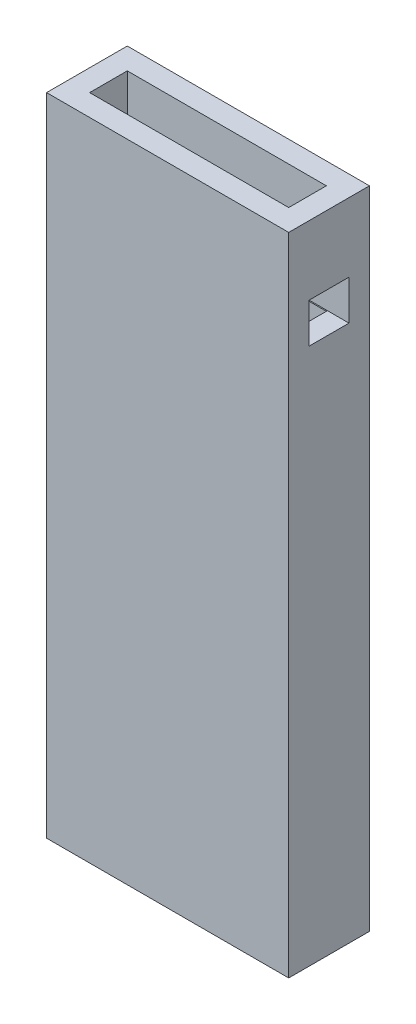
ISO-10303-21;
HEADER;
FILE_DESCRIPTION(('STEP AP214'),'2;1');
FILE_NAME('part.step','',(''),(''),'','','');
FILE_SCHEMA(('AUTOMOTIVE_DESIGN { 1 0 10303 214 1 1 1 1 }'));
ENDSEC;
DATA;
#1=APPLICATION_CONTEXT('core data for automotive mechanical design processes');
#2=APPLICATION_PROTOCOL_DEFINITION('international standard','automotive_design',2000,#1);
#3=PRODUCT_CONTEXT('',#1,'mechanical');
#4=PRODUCT('Part','Part','',(#3));
#5=PRODUCT_RELATED_PRODUCT_CATEGORY('part','',(#4));
#6=PRODUCT_DEFINITION_FORMATION('','',#4);
#7=PRODUCT_DEFINITION_CONTEXT('part definition',#1,'design');
#8=PRODUCT_DEFINITION('design','',#6,#7);
#9=PRODUCT_DEFINITION_SHAPE('','',#8);
#10=(LENGTH_UNIT() NAMED_UNIT(*) SI_UNIT(.MILLI.,.METRE.));
#11=(NAMED_UNIT(*) PLANE_ANGLE_UNIT() SI_UNIT($,.RADIAN.));
#12=(NAMED_UNIT(*) SI_UNIT($,.STERADIAN.) SOLID_ANGLE_UNIT());
#13=UNCERTAINTY_MEASURE_WITH_UNIT(LENGTH_MEASURE(1.E-05),#10,'distance_accuracy_value','');
#14=(GEOMETRIC_REPRESENTATION_CONTEXT(3) GLOBAL_UNCERTAINTY_ASSIGNED_CONTEXT((#13)) GLOBAL_UNIT_ASSIGNED_CONTEXT((#10,
#11,#12)) REPRESENTATION_CONTEXT('',''));
#15=CARTESIAN_POINT('',(0.,0.,0.));
#16=DIRECTION('',(0.,0.,1.));
#17=DIRECTION('',(1.,0.,0.));
#18=AXIS2_PLACEMENT_3D('',#15,#16,#17);
#19=CARTESIAN_POINT('',(11.3,-55.2,2.13619599600161));
#20=DIRECTION('',(-1.,0.,0.));
#21=DIRECTION('',(0.,0.,-1.));
#22=AXIS2_PLACEMENT_3D('',#19,#20,#21);
#23=PLANE('',#22);
#24=DIRECTION('',(0.,0.,1.));
#25=VECTOR('',#24,1.);
#26=CARTESIAN_POINT('',(11.3,-58.8,2.13619599600161));
#27=LINE('',#26,#25);
#28=CARTESIAN_POINT('',(11.3,-58.8,-2.13619599600162));
#29=VERTEX_POINT('',#28);
#30=CARTESIAN_POINT('',(11.3,-58.8,2.13619599600161));
#31=VERTEX_POINT('',#30);
#32=EDGE_CURVE('E301',#29,#31,#27,.T.);
#33=ORIENTED_EDGE('',*,*,#32,.F.);
#34=DIRECTION('',(0.,-1.,0.));
#35=VECTOR('',#34,1.);
#36=CARTESIAN_POINT('',(11.3,-55.2,-2.13619599600162));
#37=LINE('',#36,#35);
#38=CARTESIAN_POINT('',(11.3,-55.2,-2.13619599600162));
#39=VERTEX_POINT('',#38);
#40=EDGE_CURVE('E336',#39,#29,#37,.T.);
#41=ORIENTED_EDGE('',*,*,#40,.F.);
#42=DIRECTION('',(0.,0.,1.));
#43=VECTOR('',#42,1.);
#44=CARTESIAN_POINT('',(11.3,-55.2,2.13619599600161));
#45=LINE('',#44,#43);
#46=CARTESIAN_POINT('',(11.3,-55.2,2.13619599600161));
#47=VERTEX_POINT('',#46);
#48=EDGE_CURVE('E343',#39,#47,#45,.T.);
#49=ORIENTED_EDGE('',*,*,#48,.T.);
#50=DIRECTION('',(0.,-1.,0.));
#51=VECTOR('',#50,1.);
#52=CARTESIAN_POINT('',(11.3,-55.2,2.13619599600161));
#53=LINE('',#52,#51);
#54=EDGE_CURVE('E320',#47,#31,#53,.T.);
#55=ORIENTED_EDGE('',*,*,#54,.T.);
#56=EDGE_LOOP('',(#33,#41,#49,#55));
#57=FACE_BOUND('',#56,.T.);
#58=ADVANCED_FACE('F36',(#57),#23,.F.);
#59=CARTESIAN_POINT('',(11.3,-55.2,-2.13619599600162));
#60=DIRECTION('',(-0.5,0.,-0.866025403784438));
#61=DIRECTION('',(0.866025403784439,0.,-0.5));
#62=AXIS2_PLACEMENT_3D('',#59,#60,#61);
#63=PLANE('',#62);
#64=DIRECTION('',(-0.866025403784439,0.,0.5));
#65=VECTOR('',#64,1.);
#66=CARTESIAN_POINT('',(11.3,-58.8,-2.13619599600162));
#67=LINE('',#66,#65);
#68=CARTESIAN_POINT('',(15.,-58.8,-4.27239199200324));
#69=VERTEX_POINT('',#68);
#70=EDGE_CURVE('E340',#69,#29,#67,.T.);
#71=ORIENTED_EDGE('',*,*,#70,.F.);
#72=DIRECTION('',(0.,-1.,0.));
#73=VECTOR('',#72,1.);
#74=CARTESIAN_POINT('',(15.,-55.2,-4.27239199200324));
#75=LINE('',#74,#73);
#76=CARTESIAN_POINT('',(15.,-55.2,-4.27239199200324));
#77=VERTEX_POINT('',#76);
#78=EDGE_CURVE('E333',#77,#69,#75,.T.);
#79=ORIENTED_EDGE('',*,*,#78,.F.);
#80=DIRECTION('',(-0.866025403784439,0.,0.5));
#81=VECTOR('',#80,1.);
#82=CARTESIAN_POINT('',(11.3,-55.2,-2.13619599600162));
#83=LINE('',#82,#81);
#84=EDGE_CURVE('E323',#77,#39,#83,.T.);
#85=ORIENTED_EDGE('',*,*,#84,.T.);
#86=ORIENTED_EDGE('',*,*,#40,.T.);
#87=EDGE_LOOP('',(#71,#79,#85,#86));
#88=FACE_BOUND('',#87,.T.);
#89=ADVANCED_FACE('F587',(#88),#63,.F.);
#90=CARTESIAN_POINT('',(15.,-55.2,-4.27239199200324));
#91=DIRECTION('',(0.5,0.,-0.866025403784439));
#92=DIRECTION('',(0.866025403784439,0.,0.5));
#93=AXIS2_PLACEMENT_3D('',#90,#91,#92);
#94=PLANE('',#93);
#95=DIRECTION('',(-0.866025403784439,0.,-0.5));
#96=VECTOR('',#95,1.);
#97=CARTESIAN_POINT('',(15.,-58.8,-4.27239199200324));
#98=LINE('',#97,#96);
#99=CARTESIAN_POINT('',(18.7,-58.8,-2.13619599600163));
#100=VERTEX_POINT('',#99);
#101=EDGE_CURVE('E342',#100,#69,#98,.T.);
#102=ORIENTED_EDGE('',*,*,#101,.F.);
#103=DIRECTION('',(0.,-1.,0.));
#104=VECTOR('',#103,1.);
#105=CARTESIAN_POINT('',(18.7,-55.2,-2.13619599600163));
#106=LINE('',#105,#104);
#107=CARTESIAN_POINT('',(18.7,-55.2,-2.13619599600163));
#108=VERTEX_POINT('',#107);
#109=EDGE_CURVE('E330',#108,#100,#106,.T.);
#110=ORIENTED_EDGE('',*,*,#109,.F.);
#111=DIRECTION('',(-0.866025403784439,0.,-0.5));
#112=VECTOR('',#111,1.);
#113=CARTESIAN_POINT('',(15.,-55.2,-4.27239199200324));
#114=LINE('',#113,#112);
#115=EDGE_CURVE('E354',#108,#77,#114,.T.);
#116=ORIENTED_EDGE('',*,*,#115,.T.);
#117=ORIENTED_EDGE('',*,*,#78,.T.);
#118=EDGE_LOOP('',(#102,#110,#116,#117));
#119=FACE_BOUND('',#118,.T.);
#120=ADVANCED_FACE('F593',(#119),#94,.F.);
#121=CARTESIAN_POINT('',(18.7,-55.2,-2.13619599600163));
#122=DIRECTION('',(1.,0.,0.));
#123=DIRECTION('',(0.,0.,1.));
#124=AXIS2_PLACEMENT_3D('',#121,#122,#123);
#125=PLANE('',#124);
#126=DIRECTION('',(0.,0.,-1.));
#127=VECTOR('',#126,1.);
#128=CARTESIAN_POINT('',(18.7,-58.8,-2.13619599600163));
#129=LINE('',#128,#127);
#130=CARTESIAN_POINT('',(18.7,-58.8,2.13619599600161));
#131=VERTEX_POINT('',#130);
#132=EDGE_CURVE('E345',#131,#100,#129,.T.);
#133=ORIENTED_EDGE('',*,*,#132,.F.);
#134=DIRECTION('',(0.,-1.,0.));
#135=VECTOR('',#134,1.);
#136=CARTESIAN_POINT('',(18.7,-55.2,2.13619599600161));
#137=LINE('',#136,#135);
#138=CARTESIAN_POINT('',(18.7,-55.2,2.13619599600161));
#139=VERTEX_POINT('',#138);
#140=EDGE_CURVE('E327',#139,#131,#137,.T.);
#141=ORIENTED_EDGE('',*,*,#140,.F.);
#142=DIRECTION('',(0.,0.,-1.));
#143=VECTOR('',#142,1.);
#144=CARTESIAN_POINT('',(18.7,-55.2,-2.13619599600163));
#145=LINE('',#144,#143);
#146=EDGE_CURVE('E356',#139,#108,#145,.T.);
#147=ORIENTED_EDGE('',*,*,#146,.T.);
#148=ORIENTED_EDGE('',*,*,#109,.T.);
#149=EDGE_LOOP('',(#133,#141,#147,#148));
#150=FACE_BOUND('',#149,.T.);
#151=ADVANCED_FACE('F608',(#150),#125,.F.);
#152=CARTESIAN_POINT('',(18.7,-55.2,2.13619599600161));
#153=DIRECTION('',(0.5,0.,0.866025403784438));
#154=DIRECTION('',(-0.866025403784439,0.,0.5));
#155=AXIS2_PLACEMENT_3D('',#152,#153,#154);
#156=PLANE('',#155);
#157=DIRECTION('',(0.866025403784439,0.,-0.5));
#158=VECTOR('',#157,1.);
#159=CARTESIAN_POINT('',(18.7,-58.8,2.13619599600161));
#160=LINE('',#159,#158);
#161=CARTESIAN_POINT('',(15.,-58.8,4.27239199200323));
#162=VERTEX_POINT('',#161);
#163=EDGE_CURVE('E347',#162,#131,#160,.T.);
#164=ORIENTED_EDGE('',*,*,#163,.F.);
#165=DIRECTION('',(0.,-1.,0.));
#166=VECTOR('',#165,1.);
#167=CARTESIAN_POINT('',(15.,-55.2,4.27239199200323));
#168=LINE('',#167,#166);
#169=CARTESIAN_POINT('',(15.,-55.2,4.27239199200323));
#170=VERTEX_POINT('',#169);
#171=EDGE_CURVE('E324',#170,#162,#168,.T.);
#172=ORIENTED_EDGE('',*,*,#171,.F.);
#173=DIRECTION('',(0.866025403784439,0.,-0.5));
#174=VECTOR('',#173,1.);
#175=CARTESIAN_POINT('',(18.7,-55.2,2.13619599600161));
#176=LINE('',#175,#174);
#177=EDGE_CURVE('E358',#170,#139,#176,.T.);
#178=ORIENTED_EDGE('',*,*,#177,.T.);
#179=ORIENTED_EDGE('',*,*,#140,.T.);
#180=EDGE_LOOP('',(#164,#172,#178,#179));
#181=FACE_BOUND('',#180,.T.);
#182=ADVANCED_FACE('F604',(#181),#156,.F.);
#183=CARTESIAN_POINT('',(15.,-55.2,4.27239199200323));
#184=DIRECTION('',(-0.5,0.,0.866025403784439));
#185=DIRECTION('',(-0.866025403784439,0.,-0.5));
#186=AXIS2_PLACEMENT_3D('',#183,#184,#185);
#187=PLANE('',#186);
#188=DIRECTION('',(0.866025403784439,0.,0.5));
#189=VECTOR('',#188,1.);
#190=CARTESIAN_POINT('',(15.,-58.8,4.27239199200323));
#191=LINE('',#190,#189);
#192=EDGE_CURVE('E349',#31,#162,#191,.T.);
#193=ORIENTED_EDGE('',*,*,#192,.F.);
#194=ORIENTED_EDGE('',*,*,#54,.F.);
#195=DIRECTION('',(0.866025403784439,0.,0.5));
#196=VECTOR('',#195,1.);
#197=CARTESIAN_POINT('',(15.,-55.2,4.27239199200323));
#198=LINE('',#197,#196);
#199=EDGE_CURVE('E360',#47,#170,#198,.T.);
#200=ORIENTED_EDGE('',*,*,#199,.T.);
#201=ORIENTED_EDGE('',*,*,#171,.T.);
#202=EDGE_LOOP('',(#193,#194,#200,#201));
#203=FACE_BOUND('',#202,.T.);
#204=ADVANCED_FACE('F600',(#203),#187,.F.);
#205=CARTESIAN_POINT('',(0.,-55.2,0.));
#206=DIRECTION('',(0.,1.,0.));
#207=DIRECTION('',(0.,0.,-1.));
#208=AXIS2_PLACEMENT_3D('',#205,#206,#207);
#209=PLANE('',#208);
#210=ORIENTED_EDGE('',*,*,#48,.F.);
#211=ORIENTED_EDGE('',*,*,#84,.F.);
#212=ORIENTED_EDGE('',*,*,#115,.F.);
#213=ORIENTED_EDGE('',*,*,#146,.F.);
#214=ORIENTED_EDGE('',*,*,#177,.F.);
#215=ORIENTED_EDGE('',*,*,#199,.F.);
#216=EDGE_LOOP('',(#210,#211,#212,#213,#214,#215));
#217=FACE_BOUND('',#216,.T.);
#218=ADVANCED_FACE('F603',(#217),#209,.F.);
#219=CARTESIAN_POINT('',(0.,-58.8,0.));
#220=DIRECTION('',(0.,1.,0.));
#221=DIRECTION('',(0.,0.,-1.));
#222=AXIS2_PLACEMENT_3D('',#219,#220,#221);
#223=PLANE('',#222);
#224=CARTESIAN_POINT('',(15.,-58.8,0.));
#225=DIRECTION('',(0.,-1.,0.));
#226=DIRECTION('',(0.,0.,-1.));
#227=AXIS2_PLACEMENT_3D('',#224,#225,#226);
#228=CIRCLE('',#227,2.1);
#229=CARTESIAN_POINT('',(15.,-58.8,-2.1));
#230=VERTEX_POINT('',#229);
#231=EDGE_CURVE('E1015',#230,#230,#228,.F.);
#232=ORIENTED_EDGE('',*,*,#231,.F.);
#233=EDGE_LOOP('',(#232));
#234=FACE_BOUND('',#233,.T.);
#235=ORIENTED_EDGE('',*,*,#32,.T.);
#236=ORIENTED_EDGE('',*,*,#192,.T.);
#237=ORIENTED_EDGE('',*,*,#163,.T.);
#238=ORIENTED_EDGE('',*,*,#132,.T.);
#239=ORIENTED_EDGE('',*,*,#101,.T.);
#240=ORIENTED_EDGE('',*,*,#70,.T.);
#241=EDGE_LOOP('',(#235,#236,#237,#238,#239,#240));
#242=FACE_BOUND('',#241,.T.);
#243=ADVANCED_FACE('F616',(#234,#242),#223,.T.);
#244=CARTESIAN_POINT('',(15.,60.001,0.));
#245=DIRECTION('',(0.,-1.,0.));
#246=DIRECTION('',(0.,0.,1.));
#247=AXIS2_PLACEMENT_3D('',#244,#245,#246);
#248=CYLINDRICAL_SURFACE('',#247,2.1);
#249=ORIENTED_EDGE('',*,*,#231,.T.);
#250=EDGE_LOOP('',(#249));
#251=FACE_BOUND('',#250,.T.);
#252=CARTESIAN_POINT('',(15.,-60.,0.));
#253=DIRECTION('',(0.,1.,0.));
#254=DIRECTION('',(0.,0.,-1.));
#255=AXIS2_PLACEMENT_3D('',#252,#253,#254);
#256=CIRCLE('',#255,2.1);
#257=CARTESIAN_POINT('',(15.,-60.,-2.1));
#258=VERTEX_POINT('',#257);
#259=EDGE_CURVE('E290',#258,#258,#256,.T.);
#260=ORIENTED_EDGE('',*,*,#259,.F.);
#261=EDGE_LOOP('',(#260));
#262=FACE_BOUND('',#261,.T.);
#263=ADVANCED_FACE('F619',(#251,#262),#248,.F.);
#264=CARTESIAN_POINT('',(-18.5,60.,-7.5));
#265=DIRECTION('',(1.,0.,0.));
#266=DIRECTION('',(0.,0.,1.));
#267=AXIS2_PLACEMENT_3D('',#264,#265,#266);
#268=PLANE('',#267);
#269=DIRECTION('',(0.,0.,-1.));
#270=VECTOR('',#269,1.);
#271=CARTESIAN_POINT('',(-18.5,47.2,-7.5));
#272=LINE('',#271,#270);
#273=CARTESIAN_POINT('',(-18.5,47.2,3.5));
#274=VERTEX_POINT('',#273);
#275=CARTESIAN_POINT('',(-18.5,47.2,-3.5));
#276=VERTEX_POINT('',#275);
#277=EDGE_CURVE('E405',#274,#276,#272,.T.);
#278=ORIENTED_EDGE('',*,*,#277,.T.);
#279=DIRECTION('',(0.,-1.,0.));
#280=VECTOR('',#279,1.);
#281=CARTESIAN_POINT('',(-18.5,60.,-3.5));
#282=LINE('',#281,#280);
#283=CARTESIAN_POINT('',(-18.5,60.,-3.5));
#284=VERTEX_POINT('',#283);
#285=EDGE_CURVE('E452',#284,#276,#282,.T.);
#286=ORIENTED_EDGE('',*,*,#285,.F.);
#287=DIRECTION('',(0.,0.,-1.));
#288=VECTOR('',#287,1.);
#289=CARTESIAN_POINT('',(-18.5,60.,-7.5));
#290=LINE('',#289,#288);
#291=CARTESIAN_POINT('',(-18.5,60.,3.5));
#292=VERTEX_POINT('',#291);
#293=EDGE_CURVE('E477',#292,#284,#290,.T.);
#294=ORIENTED_EDGE('',*,*,#293,.F.);
#295=DIRECTION('',(0.,-1.,0.));
#296=VECTOR('',#295,1.);
#297=CARTESIAN_POINT('',(-18.5,60.,3.5));
#298=LINE('',#297,#296);
#299=EDGE_CURVE('E457',#292,#274,#298,.T.);
#300=ORIENTED_EDGE('',*,*,#299,.T.);
#301=EDGE_LOOP('',(#278,#286,#294,#300));
#302=FACE_BOUND('',#301,.T.);
#303=ADVANCED_FACE('F560',(#302),#268,.T.);
#304=CARTESIAN_POINT('',(22.5,60.,-3.5));
#305=DIRECTION('',(0.,0.,1.));
#306=DIRECTION('',(-1.,0.,0.));
#307=AXIS2_PLACEMENT_3D('',#304,#305,#306);
#308=PLANE('',#307);
#309=DIRECTION('',(1.,0.,0.));
#310=VECTOR('',#309,1.);
#311=CARTESIAN_POINT('',(22.5,47.2,-3.5));
#312=LINE('',#311,#310);
#313=CARTESIAN_POINT('',(-5.,47.2,-3.5));
#314=VERTEX_POINT('',#313);
#315=EDGE_CURVE('E400',#276,#314,#312,.T.);
#316=ORIENTED_EDGE('',*,*,#315,.T.);
#317=DIRECTION('',(0.,-1.,0.));
#318=VECTOR('',#317,1.);
#319=CARTESIAN_POINT('',(-5.00000000000001,50.,-3.5));
#320=LINE('',#319,#318);
#321=CARTESIAN_POINT('',(-5.00000000000001,50.,-3.5));
#322=VERTEX_POINT('',#321);
#323=EDGE_CURVE('E419',#322,#314,#320,.T.);
#324=ORIENTED_EDGE('',*,*,#323,.F.);
#325=DIRECTION('',(-1.,0.,0.));
#326=VECTOR('',#325,1.);
#327=CARTESIAN_POINT('',(5.,50.,-3.5));
#328=LINE('',#327,#326);
#329=CARTESIAN_POINT('',(5.,50.,-3.5));
#330=VERTEX_POINT('',#329);
#331=EDGE_CURVE('E437',#330,#322,#328,.T.);
#332=ORIENTED_EDGE('',*,*,#331,.F.);
#333=DIRECTION('',(0.,1.,0.));
#334=VECTOR('',#333,1.);
#335=CARTESIAN_POINT('',(5.,50.,-3.5));
#336=LINE('',#335,#334);
#337=CARTESIAN_POINT('',(5.,47.2,-3.49999999999999));
#338=VERTEX_POINT('',#337);
#339=EDGE_CURVE('E441',#338,#330,#336,.T.);
#340=ORIENTED_EDGE('',*,*,#339,.F.);
#341=CARTESIAN_POINT('',(18.5,47.2,-3.5));
#342=VERTEX_POINT('',#341);
#343=EDGE_CURVE('E396',#338,#342,#312,.T.);
#344=ORIENTED_EDGE('',*,*,#343,.T.);
#345=DIRECTION('',(0.,-1.,0.));
#346=VECTOR('',#345,1.);
#347=CARTESIAN_POINT('',(18.5,60.,-3.5));
#348=LINE('',#347,#346);
#349=CARTESIAN_POINT('',(18.5,60.,-3.5));
#350=VERTEX_POINT('',#349);
#351=EDGE_CURVE('E465',#350,#342,#348,.T.);
#352=ORIENTED_EDGE('',*,*,#351,.F.);
#353=DIRECTION('',(1.,0.,0.));
#354=VECTOR('',#353,1.);
#355=CARTESIAN_POINT('',(22.5,60.,-3.5));
#356=LINE('',#355,#354);
#357=EDGE_CURVE('E480',#284,#350,#356,.T.);
#358=ORIENTED_EDGE('',*,*,#357,.F.);
#359=ORIENTED_EDGE('',*,*,#285,.T.);
#360=EDGE_LOOP('',(#316,#324,#332,#340,#344,#352,#358,#359));
#361=FACE_BOUND('',#360,.T.);
#362=ADVANCED_FACE('F555',(#361),#308,.T.);
#363=CARTESIAN_POINT('',(18.5,60.,-7.5));
#364=DIRECTION('',(-1.,0.,0.));
#365=DIRECTION('',(0.,0.,-1.));
#366=AXIS2_PLACEMENT_3D('',#363,#364,#365);
#367=PLANE('',#366);
#368=DIRECTION('',(0.,0.,1.));
#369=VECTOR('',#368,1.);
#370=CARTESIAN_POINT('',(18.5,47.2,-7.5));
#371=LINE('',#370,#369);
#372=CARTESIAN_POINT('',(18.5,47.2,3.5));
#373=VERTEX_POINT('',#372);
#374=EDGE_CURVE('E399',#342,#373,#371,.T.);
#375=ORIENTED_EDGE('',*,*,#374,.T.);
#376=DIRECTION('',(0.,-1.,0.));
#377=VECTOR('',#376,1.);
#378=CARTESIAN_POINT('',(18.5,60.,3.5));
#379=LINE('',#378,#377);
#380=CARTESIAN_POINT('',(18.5,60.,3.5));
#381=VERTEX_POINT('',#380);
#382=EDGE_CURVE('E472',#381,#373,#379,.T.);
#383=ORIENTED_EDGE('',*,*,#382,.F.);
#384=DIRECTION('',(0.,0.,1.));
#385=VECTOR('',#384,1.);
#386=CARTESIAN_POINT('',(18.5,60.,-7.5));
#387=LINE('',#386,#385);
#388=EDGE_CURVE('E483',#350,#381,#387,.T.);
#389=ORIENTED_EDGE('',*,*,#388,.F.);
#390=ORIENTED_EDGE('',*,*,#351,.T.);
#391=EDGE_LOOP('',(#375,#383,#389,#390));
#392=FACE_BOUND('',#391,.T.);
#393=ADVANCED_FACE('F566',(#392),#367,.T.);
#394=CARTESIAN_POINT('',(22.5,60.,3.5));
#395=DIRECTION('',(0.,0.,-1.));
#396=DIRECTION('',(1.,0.,0.));
#397=AXIS2_PLACEMENT_3D('',#394,#395,#396);
#398=PLANE('',#397);
#399=DIRECTION('',(-1.,0.,0.));
#400=VECTOR('',#399,1.);
#401=CARTESIAN_POINT('',(22.5,47.2,3.5));
#402=LINE('',#401,#400);
#403=EDGE_CURVE('E403',#373,#274,#402,.T.);
#404=ORIENTED_EDGE('',*,*,#403,.T.);
#405=ORIENTED_EDGE('',*,*,#299,.F.);
#406=DIRECTION('',(-1.,0.,0.));
#407=VECTOR('',#406,1.);
#408=CARTESIAN_POINT('',(22.5,60.,3.5));
#409=LINE('',#408,#407);
#410=EDGE_CURVE('E486',#381,#292,#409,.T.);
#411=ORIENTED_EDGE('',*,*,#410,.F.);
#412=ORIENTED_EDGE('',*,*,#382,.T.);
#413=EDGE_LOOP('',(#404,#405,#411,#412));
#414=FACE_BOUND('',#413,.T.);
#415=ADVANCED_FACE('F564',(#414),#398,.T.);
#416=CARTESIAN_POINT('',(-22.5,60.,-7.5));
#417=DIRECTION('',(1.,0.,0.));
#418=DIRECTION('',(0.,0.,1.));
#419=AXIS2_PLACEMENT_3D('',#416,#417,#418);
#420=PLANE('',#419);
#421=DIRECTION('',(0.,0.,-1.));
#422=VECTOR('',#421,1.);
#423=CARTESIAN_POINT('',(-22.5,47.2,3.7));
#424=LINE('',#423,#422);
#425=CARTESIAN_POINT('',(-22.5,47.2,3.7));
#426=VERTEX_POINT('',#425);
#427=CARTESIAN_POINT('',(-22.5,47.2,-3.7));
#428=VERTEX_POINT('',#427);
#429=EDGE_CURVE('E371',#426,#428,#424,.T.);
#430=ORIENTED_EDGE('',*,*,#429,.F.);
#431=DIRECTION('',(0.,1.,0.));
#432=VECTOR('',#431,1.);
#433=CARTESIAN_POINT('',(-22.5,39.8,3.7));
#434=LINE('',#433,#432);
#435=CARTESIAN_POINT('',(-22.5,39.8,3.7));
#436=VERTEX_POINT('',#435);
#437=EDGE_CURVE('E369',#436,#426,#434,.T.);
#438=ORIENTED_EDGE('',*,*,#437,.F.);
#439=DIRECTION('',(0.,0.,1.));
#440=VECTOR('',#439,1.);
#441=CARTESIAN_POINT('',(-22.5,39.8,3.7));
#442=LINE('',#441,#440);
#443=CARTESIAN_POINT('',(-22.5,39.8,-3.7));
#444=VERTEX_POINT('',#443);
#445=EDGE_CURVE('E366',#444,#436,#442,.T.);
#446=ORIENTED_EDGE('',*,*,#445,.F.);
#447=DIRECTION('',(0.,-1.,0.));
#448=VECTOR('',#447,1.);
#449=CARTESIAN_POINT('',(-22.5,39.8,-3.7));
#450=LINE('',#449,#448);
#451=EDGE_CURVE('E364',#428,#444,#450,.T.);
#452=ORIENTED_EDGE('',*,*,#451,.F.);
#453=EDGE_LOOP('',(#430,#438,#446,#452));
#454=FACE_BOUND('',#453,.T.);
#455=DIRECTION('',(0.,0.,-1.));
#456=VECTOR('',#455,1.);
#457=CARTESIAN_POINT('',(-22.5,-60.,-7.5));
#458=LINE('',#457,#456);
#459=CARTESIAN_POINT('',(-22.5,-60.,7.5));
#460=VERTEX_POINT('',#459);
#461=CARTESIAN_POINT('',(-22.5,-60.,-7.5));
#462=VERTEX_POINT('',#461);
#463=EDGE_CURVE('E455',#460,#462,#458,.T.);
#464=ORIENTED_EDGE('',*,*,#463,.F.);
#465=DIRECTION('',(0.,-1.,0.));
#466=VECTOR('',#465,1.);
#467=CARTESIAN_POINT('',(-22.5,60.,7.5));
#468=LINE('',#467,#466);
#469=CARTESIAN_POINT('',(-22.5,60.,7.5));
#470=VERTEX_POINT('',#469);
#471=EDGE_CURVE('E500',#470,#460,#468,.T.);
#472=ORIENTED_EDGE('',*,*,#471,.F.);
#473=DIRECTION('',(0.,0.,-1.));
#474=VECTOR('',#473,1.);
#475=CARTESIAN_POINT('',(-22.5,60.,-7.5));
#476=LINE('',#475,#474);
#477=CARTESIAN_POINT('',(-22.5,60.,-7.5));
#478=VERTEX_POINT('',#477);
#479=EDGE_CURVE('E488',#470,#478,#476,.T.);
#480=ORIENTED_EDGE('',*,*,#479,.T.);
#481=DIRECTION('',(0.,-1.,0.));
#482=VECTOR('',#481,1.);
#483=CARTESIAN_POINT('',(-22.5,60.,-7.5));
#484=LINE('',#483,#482);
#485=EDGE_CURVE('E518',#478,#462,#484,.T.);
#486=ORIENTED_EDGE('',*,*,#485,.T.);
#487=EDGE_LOOP('',(#464,#472,#480,#486));
#488=FACE_BOUND('',#487,.T.);
#489=ADVANCED_FACE('F38',(#454,#488),#420,.F.);
#490=CARTESIAN_POINT('',(22.5,60.,-7.5));
#491=DIRECTION('',(0.,0.,1.));
#492=DIRECTION('',(-1.,0.,0.));
#493=AXIS2_PLACEMENT_3D('',#490,#491,#492);
#494=PLANE('',#493);
#495=DIRECTION('',(1.,0.,0.));
#496=VECTOR('',#495,1.);
#497=CARTESIAN_POINT('',(5.,40.,-7.5));
#498=LINE('',#497,#496);
#499=CARTESIAN_POINT('',(-5.,40.,-7.5));
#500=VERTEX_POINT('',#499);
#501=CARTESIAN_POINT('',(5.,40.,-7.5));
#502=VERTEX_POINT('',#501);
#503=EDGE_CURVE('E427',#500,#502,#498,.T.);
#504=ORIENTED_EDGE('',*,*,#503,.T.);
#505=DIRECTION('',(0.,1.,0.));
#506=VECTOR('',#505,1.);
#507=CARTESIAN_POINT('',(5.,50.,-7.5));
#508=LINE('',#507,#506);
#509=CARTESIAN_POINT('',(5.,50.,-7.5));
#510=VERTEX_POINT('',#509);
#511=EDGE_CURVE('E424',#502,#510,#508,.T.);
#512=ORIENTED_EDGE('',*,*,#511,.T.);
#513=DIRECTION('',(-1.,0.,0.));
#514=VECTOR('',#513,1.);
#515=CARTESIAN_POINT('',(5.,50.,-7.5));
#516=LINE('',#515,#514);
#517=CARTESIAN_POINT('',(-5.00000000000001,50.,-7.5));
#518=VERTEX_POINT('',#517);
#519=EDGE_CURVE('E420',#510,#518,#516,.T.);
#520=ORIENTED_EDGE('',*,*,#519,.T.);
#521=DIRECTION('',(0.,-1.,0.));
#522=VECTOR('',#521,1.);
#523=CARTESIAN_POINT('',(-5.00000000000001,50.,-7.5));
#524=LINE('',#523,#522);
#525=EDGE_CURVE('E430',#518,#500,#524,.T.);
#526=ORIENTED_EDGE('',*,*,#525,.T.);
#527=EDGE_LOOP('',(#504,#512,#520,#526));
#528=FACE_BOUND('',#527,.T.);
#529=DIRECTION('',(1.,0.,0.));
#530=VECTOR('',#529,1.);
#531=CARTESIAN_POINT('',(22.5,-60.,-7.5));
#532=LINE('',#531,#530);
#533=CARTESIAN_POINT('',(22.5,-60.,-7.5));
#534=VERTEX_POINT('',#533);
#535=EDGE_CURVE('E503',#462,#534,#532,.T.);
#536=ORIENTED_EDGE('',*,*,#535,.F.);
#537=ORIENTED_EDGE('',*,*,#485,.F.);
#538=DIRECTION('',(1.,0.,0.));
#539=VECTOR('',#538,1.);
#540=CARTESIAN_POINT('',(22.5,60.,-7.5));
#541=LINE('',#540,#539);
#542=CARTESIAN_POINT('',(22.5,60.,-7.5));
#543=VERTEX_POINT('',#542);
#544=EDGE_CURVE('E491',#478,#543,#541,.T.);
#545=ORIENTED_EDGE('',*,*,#544,.T.);
#546=DIRECTION('',(0.,-1.,0.));
#547=VECTOR('',#546,1.);
#548=CARTESIAN_POINT('',(22.5,60.,-7.5));
#549=LINE('',#548,#547);
#550=EDGE_CURVE('E515',#543,#534,#549,.T.);
#551=ORIENTED_EDGE('',*,*,#550,.T.);
#552=EDGE_LOOP('',(#536,#537,#545,#551));
#553=FACE_BOUND('',#552,.T.);
#554=ADVANCED_FACE('F572',(#528,#553),#494,.F.);
#555=CARTESIAN_POINT('',(22.5,60.,-7.5));
#556=DIRECTION('',(-1.,0.,0.));
#557=DIRECTION('',(0.,0.,-1.));
#558=AXIS2_PLACEMENT_3D('',#555,#556,#557);
#559=PLANE('',#558);
#560=DIRECTION('',(0.,0.,1.));
#561=VECTOR('',#560,1.);
#562=CARTESIAN_POINT('',(22.5,39.8,3.7));
#563=LINE('',#562,#561);
#564=CARTESIAN_POINT('',(22.5,39.8,-3.7));
#565=VERTEX_POINT('',#564);
#566=CARTESIAN_POINT('',(22.5,39.8,3.7));
#567=VERTEX_POINT('',#566);
#568=EDGE_CURVE('E375',#565,#567,#563,.T.);
#569=ORIENTED_EDGE('',*,*,#568,.T.);
#570=DIRECTION('',(0.,1.,0.));
#571=VECTOR('',#570,1.);
#572=CARTESIAN_POINT('',(22.5,39.8,3.7));
#573=LINE('',#572,#571);
#574=CARTESIAN_POINT('',(22.5,47.2,3.7));
#575=VERTEX_POINT('',#574);
#576=EDGE_CURVE('E378',#567,#575,#573,.T.);
#577=ORIENTED_EDGE('',*,*,#576,.T.);
#578=DIRECTION('',(0.,0.,-1.));
#579=VECTOR('',#578,1.);
#580=CARTESIAN_POINT('',(22.5,47.2,3.7));
#581=LINE('',#580,#579);
#582=CARTESIAN_POINT('',(22.5,47.2,-3.7));
#583=VERTEX_POINT('',#582);
#584=EDGE_CURVE('E367',#575,#583,#581,.T.);
#585=ORIENTED_EDGE('',*,*,#584,.T.);
#586=DIRECTION('',(0.,-1.,0.));
#587=VECTOR('',#586,1.);
#588=CARTESIAN_POINT('',(22.5,39.8,-3.7));
#589=LINE('',#588,#587);
#590=EDGE_CURVE('E309',#583,#565,#589,.T.);
#591=ORIENTED_EDGE('',*,*,#590,.T.);
#592=EDGE_LOOP('',(#569,#577,#585,#591));
#593=FACE_BOUND('',#592,.T.);
#594=DIRECTION('',(0.,0.,1.));
#595=VECTOR('',#594,1.);
#596=CARTESIAN_POINT('',(22.5,-60.,-7.5));
#597=LINE('',#596,#595);
#598=CARTESIAN_POINT('',(22.5,-60.,7.5));
#599=VERTEX_POINT('',#598);
#600=EDGE_CURVE('E506',#534,#599,#597,.T.);
#601=ORIENTED_EDGE('',*,*,#600,.F.);
#602=ORIENTED_EDGE('',*,*,#550,.F.);
#603=DIRECTION('',(0.,0.,1.));
#604=VECTOR('',#603,1.);
#605=CARTESIAN_POINT('',(22.5,60.,-7.5));
#606=LINE('',#605,#604);
#607=CARTESIAN_POINT('',(22.5,60.,7.5));
#608=VERTEX_POINT('',#607);
#609=EDGE_CURVE('E495',#543,#608,#606,.T.);
#610=ORIENTED_EDGE('',*,*,#609,.T.);
#611=DIRECTION('',(0.,-1.,0.));
#612=VECTOR('',#611,1.);
#613=CARTESIAN_POINT('',(22.5,60.,7.5));
#614=LINE('',#613,#612);
#615=EDGE_CURVE('E512',#608,#599,#614,.T.);
#616=ORIENTED_EDGE('',*,*,#615,.T.);
#617=EDGE_LOOP('',(#601,#602,#610,#616));
#618=FACE_BOUND('',#617,.T.);
#619=ADVANCED_FACE('F538',(#593,#618),#559,.F.);
#620=CARTESIAN_POINT('',(22.5,60.,7.5));
#621=DIRECTION('',(0.,0.,-1.));
#622=DIRECTION('',(1.,0.,0.));
#623=AXIS2_PLACEMENT_3D('',#620,#621,#622);
#624=PLANE('',#623);
#625=DIRECTION('',(-1.,0.,0.));
#626=VECTOR('',#625,1.);
#627=CARTESIAN_POINT('',(22.5,-60.,7.5));
#628=LINE('',#627,#626);
#629=EDGE_CURVE('E492',#599,#460,#628,.T.);
#630=ORIENTED_EDGE('',*,*,#629,.F.);
#631=ORIENTED_EDGE('',*,*,#615,.F.);
#632=DIRECTION('',(-1.,0.,0.));
#633=VECTOR('',#632,1.);
#634=CARTESIAN_POINT('',(22.5,60.,7.5));
#635=LINE('',#634,#633);
#636=EDGE_CURVE('E498',#608,#470,#635,.T.);
#637=ORIENTED_EDGE('',*,*,#636,.T.);
#638=ORIENTED_EDGE('',*,*,#471,.T.);
#639=EDGE_LOOP('',(#630,#631,#637,#638));
#640=FACE_BOUND('',#639,.T.);
#641=ADVANCED_FACE('F827',(#640),#624,.F.);
#642=CARTESIAN_POINT('',(0.,60.,0.));
#643=DIRECTION('',(0.,1.,0.));
#644=DIRECTION('',(0.,0.,-1.));
#645=AXIS2_PLACEMENT_3D('',#642,#643,#644);
#646=PLANE('',#645);
#647=ORIENTED_EDGE('',*,*,#293,.T.);
#648=ORIENTED_EDGE('',*,*,#357,.T.);
#649=ORIENTED_EDGE('',*,*,#388,.T.);
#650=ORIENTED_EDGE('',*,*,#410,.T.);
#651=EDGE_LOOP('',(#647,#648,#649,#650));
#652=FACE_BOUND('',#651,.T.);
#653=ORIENTED_EDGE('',*,*,#479,.F.);
#654=ORIENTED_EDGE('',*,*,#636,.F.);
#655=ORIENTED_EDGE('',*,*,#609,.F.);
#656=ORIENTED_EDGE('',*,*,#544,.F.);
#657=EDGE_LOOP('',(#653,#654,#655,#656));
#658=FACE_BOUND('',#657,.T.);
#659=ADVANCED_FACE('F836',(#652,#658),#646,.T.);
#660=CARTESIAN_POINT('',(0.,-60.,0.));
#661=DIRECTION('',(0.,1.,0.));
#662=DIRECTION('',(0.,0.,-1.));
#663=AXIS2_PLACEMENT_3D('',#660,#661,#662);
#664=PLANE('',#663);
#665=CARTESIAN_POINT('',(-15.,-60.,0.));
#666=DIRECTION('',(0.,1.,0.));
#667=DIRECTION('',(0.,0.,1.));
#668=AXIS2_PLACEMENT_3D('',#665,#666,#667);
#669=CIRCLE('',#668,2.1);
#670=CARTESIAN_POINT('',(-15.,-60.,2.1));
#671=VERTEX_POINT('',#670);
#672=EDGE_CURVE('E1003',#671,#671,#669,.T.);
#673=ORIENTED_EDGE('',*,*,#672,.T.);
#674=EDGE_LOOP('',(#673));
#675=FACE_BOUND('',#674,.T.);
#676=ORIENTED_EDGE('',*,*,#259,.T.);
#677=EDGE_LOOP('',(#676));
#678=FACE_BOUND('',#677,.T.);
#679=ORIENTED_EDGE('',*,*,#463,.T.);
#680=ORIENTED_EDGE('',*,*,#535,.T.);
#681=ORIENTED_EDGE('',*,*,#600,.T.);
#682=ORIENTED_EDGE('',*,*,#629,.T.);
#683=EDGE_LOOP('',(#679,#680,#681,#682));
#684=FACE_BOUND('',#683,.T.);
#685=ADVANCED_FACE('F846',(#675,#678,#684),#664,.F.);
#686=CARTESIAN_POINT('',(-5.00000000000001,50.,7.501));
#687=DIRECTION('',(-1.,0.,0.));
#688=DIRECTION('',(0.,0.,-1.));
#689=AXIS2_PLACEMENT_3D('',#686,#687,#688);
#690=PLANE('',#689);
#691=DIRECTION('',(0.,0.,-1.));
#692=VECTOR('',#691,1.);
#693=CARTESIAN_POINT('',(-5.00000000000001,40.,7.501));
#694=LINE('',#693,#692);
#695=CARTESIAN_POINT('',(-5.00000000000001,40.,-3.69999999999999));
#696=VERTEX_POINT('',#695);
#697=EDGE_CURVE('E436',#696,#500,#694,.T.);
#698=ORIENTED_EDGE('',*,*,#697,.T.);
#699=ORIENTED_EDGE('',*,*,#525,.F.);
#700=DIRECTION('',(0.,0.,-1.));
#701=VECTOR('',#700,1.);
#702=CARTESIAN_POINT('',(-5.00000000000001,50.,7.501));
#703=LINE('',#702,#701);
#704=EDGE_CURVE('E440',#322,#518,#703,.T.);
#705=ORIENTED_EDGE('',*,*,#704,.F.);
#706=ORIENTED_EDGE('',*,*,#323,.T.);
#707=DIRECTION('',(0.,0.,1.));
#708=VECTOR('',#707,1.);
#709=CARTESIAN_POINT('',(-5.00000000000001,47.2,7.501));
#710=LINE('',#709,#708);
#711=CARTESIAN_POINT('',(-5.00000000000001,47.2,-3.7));
#712=VERTEX_POINT('',#711);
#713=EDGE_CURVE('E408',#712,#314,#710,.T.);
#714=ORIENTED_EDGE('',*,*,#713,.F.);
#715=DIRECTION('',(0.,1.,0.));
#716=VECTOR('',#715,1.);
#717=CARTESIAN_POINT('',(-5.00000000000001,50.,-3.7));
#718=LINE('',#717,#716);
#719=EDGE_CURVE('E393',#696,#712,#718,.T.);
#720=ORIENTED_EDGE('',*,*,#719,.F.);
#721=EDGE_LOOP('',(#698,#699,#705,#706,#714,#720));
#722=FACE_BOUND('',#721,.T.);
#723=ADVANCED_FACE('F552',(#722),#690,.F.);
#724=CARTESIAN_POINT('',(5.,50.,7.501));
#725=DIRECTION('',(0.,1.,0.));
#726=DIRECTION('',(0.,0.,-1.));
#727=AXIS2_PLACEMENT_3D('',#724,#725,#726);
#728=PLANE('',#727);
#729=DIRECTION('',(0.,0.,-1.));
#730=VECTOR('',#729,1.);
#731=CARTESIAN_POINT('',(5.,50.,7.501));
#732=LINE('',#731,#730);
#733=EDGE_CURVE('E444',#330,#510,#732,.T.);
#734=ORIENTED_EDGE('',*,*,#733,.F.);
#735=ORIENTED_EDGE('',*,*,#331,.T.);
#736=ORIENTED_EDGE('',*,*,#704,.T.);
#737=ORIENTED_EDGE('',*,*,#519,.F.);
#738=EDGE_LOOP('',(#734,#735,#736,#737));
#739=FACE_BOUND('',#738,.T.);
#740=ADVANCED_FACE('F568',(#739),#728,.F.);
#741=CARTESIAN_POINT('',(5.,50.,7.501));
#742=DIRECTION('',(1.,0.,0.));
#743=DIRECTION('',(0.,1.,0.));
#744=AXIS2_PLACEMENT_3D('',#741,#742,#743);
#745=PLANE('',#744);
#746=DIRECTION('',(0.,0.,-1.));
#747=VECTOR('',#746,1.);
#748=CARTESIAN_POINT('',(5.,47.2,7.501));
#749=LINE('',#748,#747);
#750=CARTESIAN_POINT('',(4.99999999999999,47.2,-3.7));
#751=VERTEX_POINT('',#750);
#752=EDGE_CURVE('E44',#338,#751,#749,.T.);
#753=ORIENTED_EDGE('',*,*,#752,.F.);
#754=ORIENTED_EDGE('',*,*,#339,.T.);
#755=ORIENTED_EDGE('',*,*,#733,.T.);
#756=ORIENTED_EDGE('',*,*,#511,.F.);
#757=DIRECTION('',(0.,0.,-1.));
#758=VECTOR('',#757,1.);
#759=CARTESIAN_POINT('',(5.,40.,7.501));
#760=LINE('',#759,#758);
#761=CARTESIAN_POINT('',(5.,40.,-3.7));
#762=VERTEX_POINT('',#761);
#763=EDGE_CURVE('E433',#762,#502,#760,.T.);
#764=ORIENTED_EDGE('',*,*,#763,.F.);
#765=DIRECTION('',(0.,-1.,0.));
#766=VECTOR('',#765,1.);
#767=CARTESIAN_POINT('',(5.,50.,-3.7));
#768=LINE('',#767,#766);
#769=EDGE_CURVE('E385',#751,#762,#768,.T.);
#770=ORIENTED_EDGE('',*,*,#769,.F.);
#771=EDGE_LOOP('',(#753,#754,#755,#756,#764,#770));
#772=FACE_BOUND('',#771,.T.);
#773=ADVANCED_FACE('F530',(#772),#745,.F.);
#774=CARTESIAN_POINT('',(5.,40.,7.501));
#775=DIRECTION('',(0.,-1.,0.));
#776=DIRECTION('',(0.,0.,1.));
#777=AXIS2_PLACEMENT_3D('',#774,#775,#776);
#778=PLANE('',#777);
#779=ORIENTED_EDGE('',*,*,#763,.T.);
#780=ORIENTED_EDGE('',*,*,#503,.F.);
#781=ORIENTED_EDGE('',*,*,#697,.F.);
#782=DIRECTION('',(-1.,0.,0.));
#783=VECTOR('',#782,1.);
#784=CARTESIAN_POINT('',(5.,40.,-3.7));
#785=LINE('',#784,#783);
#786=EDGE_CURVE('E521',#762,#696,#785,.T.);
#787=ORIENTED_EDGE('',*,*,#786,.F.);
#788=EDGE_LOOP('',(#779,#780,#781,#787));
#789=FACE_BOUND('',#788,.T.);
#790=ADVANCED_FACE('F576',(#789),#778,.F.);
#791=CARTESIAN_POINT('',(-22.5,47.2,3.7));
#792=DIRECTION('',(0.,1.,0.));
#793=DIRECTION('',(0.,0.,-1.));
#794=AXIS2_PLACEMENT_3D('',#791,#792,#793);
#795=PLANE('',#794);
#796=DIRECTION('',(1.,0.,0.));
#797=VECTOR('',#796,1.);
#798=CARTESIAN_POINT('',(-22.5,47.2,-3.7));
#799=LINE('',#798,#797);
#800=EDGE_CURVE('E383',#428,#712,#799,.T.);
#801=ORIENTED_EDGE('',*,*,#800,.T.);
#802=ORIENTED_EDGE('',*,*,#713,.T.);
#803=ORIENTED_EDGE('',*,*,#315,.F.);
#804=ORIENTED_EDGE('',*,*,#277,.F.);
#805=ORIENTED_EDGE('',*,*,#403,.F.);
#806=ORIENTED_EDGE('',*,*,#374,.F.);
#807=ORIENTED_EDGE('',*,*,#343,.F.);
#808=ORIENTED_EDGE('',*,*,#752,.T.);
#809=EDGE_CURVE('E386',#751,#583,#799,.T.);
#810=ORIENTED_EDGE('',*,*,#809,.T.);
#811=ORIENTED_EDGE('',*,*,#584,.F.);
#812=DIRECTION('',(1.,0.,0.));
#813=VECTOR('',#812,1.);
#814=CARTESIAN_POINT('',(-22.5,47.2,3.7));
#815=LINE('',#814,#813);
#816=EDGE_CURVE('E387',#426,#575,#815,.T.);
#817=ORIENTED_EDGE('',*,*,#816,.F.);
#818=ORIENTED_EDGE('',*,*,#429,.T.);
#819=EDGE_LOOP('',(#801,#802,#803,#804,#805,#806,#807,#808,#810,#811,#817,#818));
#820=FACE_BOUND('',#819,.T.);
#821=ADVANCED_FACE('F525',(#820),#795,.F.);
#822=CARTESIAN_POINT('',(-22.5,39.8,-3.7));
#823=DIRECTION('',(0.,0.,-1.));
#824=DIRECTION('',(1.,0.,0.));
#825=AXIS2_PLACEMENT_3D('',#822,#823,#824);
#826=PLANE('',#825);
#827=ORIENTED_EDGE('',*,*,#786,.T.);
#828=ORIENTED_EDGE('',*,*,#719,.T.);
#829=ORIENTED_EDGE('',*,*,#800,.F.);
#830=ORIENTED_EDGE('',*,*,#451,.T.);
#831=DIRECTION('',(1.,0.,0.));
#832=VECTOR('',#831,1.);
#833=CARTESIAN_POINT('',(-22.5,39.8,-3.7));
#834=LINE('',#833,#832);
#835=EDGE_CURVE('E59',#444,#565,#834,.T.);
#836=ORIENTED_EDGE('',*,*,#835,.T.);
#837=ORIENTED_EDGE('',*,*,#590,.F.);
#838=ORIENTED_EDGE('',*,*,#809,.F.);
#839=ORIENTED_EDGE('',*,*,#769,.T.);
#840=EDGE_LOOP('',(#827,#828,#829,#830,#836,#837,#838,#839));
#841=FACE_BOUND('',#840,.T.);
#842=ADVANCED_FACE('F534',(#841),#826,.F.);
#843=CARTESIAN_POINT('',(-22.5,39.8,3.7));
#844=DIRECTION('',(0.,0.,1.));
#845=DIRECTION('',(-1.,0.,0.));
#846=AXIS2_PLACEMENT_3D('',#843,#844,#845);
#847=PLANE('',#846);
#848=ORIENTED_EDGE('',*,*,#576,.F.);
#849=DIRECTION('',(1.,0.,0.));
#850=VECTOR('',#849,1.);
#851=CARTESIAN_POINT('',(-22.5,39.8,3.7));
#852=LINE('',#851,#850);
#853=EDGE_CURVE('E51',#436,#567,#852,.T.);
#854=ORIENTED_EDGE('',*,*,#853,.F.);
#855=ORIENTED_EDGE('',*,*,#437,.T.);
#856=ORIENTED_EDGE('',*,*,#816,.T.);
#857=EDGE_LOOP('',(#848,#854,#855,#856));
#858=FACE_BOUND('',#857,.T.);
#859=ADVANCED_FACE('F542',(#858),#847,.F.);
#860=CARTESIAN_POINT('',(-22.5,39.8,3.7));
#861=DIRECTION('',(0.,-1.,0.));
#862=DIRECTION('',(0.,0.,1.));
#863=AXIS2_PLACEMENT_3D('',#860,#861,#862);
#864=PLANE('',#863);
#865=DIRECTION('',(0.,0.,1.));
#866=VECTOR('',#865,1.);
#867=CARTESIAN_POINT('',(-18.5,39.8,-7.5));
#868=LINE('',#867,#866);
#869=CARTESIAN_POINT('',(-18.5,39.8,-3.5));
#870=VERTEX_POINT('',#869);
#871=CARTESIAN_POINT('',(-18.5,39.8,3.5));
#872=VERTEX_POINT('',#871);
#873=EDGE_CURVE('E416',#870,#872,#868,.T.);
#874=ORIENTED_EDGE('',*,*,#873,.F.);
#875=DIRECTION('',(-1.,0.,0.));
#876=VECTOR('',#875,1.);
#877=CARTESIAN_POINT('',(22.5,39.8,-3.5));
#878=LINE('',#877,#876);
#879=CARTESIAN_POINT('',(18.5,39.8,-3.5));
#880=VERTEX_POINT('',#879);
#881=EDGE_CURVE('E413',#880,#870,#878,.T.);
#882=ORIENTED_EDGE('',*,*,#881,.F.);
#883=DIRECTION('',(0.,0.,-1.));
#884=VECTOR('',#883,1.);
#885=CARTESIAN_POINT('',(18.5,39.8,-7.5));
#886=LINE('',#885,#884);
#887=CARTESIAN_POINT('',(18.5,39.8,3.5));
#888=VERTEX_POINT('',#887);
#889=EDGE_CURVE('E410',#888,#880,#886,.T.);
#890=ORIENTED_EDGE('',*,*,#889,.F.);
#891=DIRECTION('',(1.,0.,0.));
#892=VECTOR('',#891,1.);
#893=CARTESIAN_POINT('',(22.5,39.8,3.5));
#894=LINE('',#893,#892);
#895=EDGE_CURVE('E11',#872,#888,#894,.T.);
#896=ORIENTED_EDGE('',*,*,#895,.F.);
#897=EDGE_LOOP('',(#874,#882,#890,#896));
#898=FACE_BOUND('',#897,.T.);
#899=ORIENTED_EDGE('',*,*,#568,.F.);
#900=ORIENTED_EDGE('',*,*,#835,.F.);
#901=ORIENTED_EDGE('',*,*,#445,.T.);
#902=ORIENTED_EDGE('',*,*,#853,.T.);
#903=EDGE_LOOP('',(#899,#900,#901,#902));
#904=FACE_BOUND('',#903,.T.);
#905=ADVANCED_FACE('F626',(#898,#904),#864,.F.);
#906=CARTESIAN_POINT('',(0.,-54.,0.));
#907=DIRECTION('',(0.,1.,0.));
#908=DIRECTION('',(0.,0.,-1.));
#909=AXIS2_PLACEMENT_3D('',#906,#907,#908);
#910=PLANE('',#909);
#911=DIRECTION('',(0.,0.,-1.));
#912=VECTOR('',#911,1.);
#913=CARTESIAN_POINT('',(-18.5,-54.,-7.5));
#914=LINE('',#913,#912);
#915=CARTESIAN_POINT('',(-18.5,-54.,3.5));
#916=VERTEX_POINT('',#915);
#917=CARTESIAN_POINT('',(-18.5,-54.,-3.5));
#918=VERTEX_POINT('',#917);
#919=EDGE_CURVE('E423',#916,#918,#914,.T.);
#920=ORIENTED_EDGE('',*,*,#919,.F.);
#921=DIRECTION('',(-1.,0.,0.));
#922=VECTOR('',#921,1.);
#923=CARTESIAN_POINT('',(22.5,-54.,3.5));
#924=LINE('',#923,#922);
#925=CARTESIAN_POINT('',(18.5,-54.,3.5));
#926=VERTEX_POINT('',#925);
#927=EDGE_CURVE('E471',#926,#916,#924,.T.);
#928=ORIENTED_EDGE('',*,*,#927,.F.);
#929=DIRECTION('',(0.,0.,1.));
#930=VECTOR('',#929,1.);
#931=CARTESIAN_POINT('',(18.5,-54.,-7.5));
#932=LINE('',#931,#930);
#933=CARTESIAN_POINT('',(18.5,-54.,-3.5));
#934=VERTEX_POINT('',#933);
#935=EDGE_CURVE('E464',#934,#926,#932,.T.);
#936=ORIENTED_EDGE('',*,*,#935,.F.);
#937=DIRECTION('',(1.,0.,0.));
#938=VECTOR('',#937,1.);
#939=CARTESIAN_POINT('',(22.5,-54.,-3.5));
#940=LINE('',#939,#938);
#941=EDGE_CURVE('E451',#918,#934,#940,.T.);
#942=ORIENTED_EDGE('',*,*,#941,.F.);
#943=EDGE_LOOP('',(#920,#928,#936,#942));
#944=FACE_BOUND('',#943,.T.);
#945=ADVANCED_FACE('F628',(#944),#910,.T.);
#946=ORIENTED_EDGE('',*,*,#895,.T.);
#947=EDGE_CURVE('E460',#888,#926,#379,.T.);
#948=ORIENTED_EDGE('',*,*,#947,.T.);
#949=ORIENTED_EDGE('',*,*,#927,.T.);
#950=EDGE_CURVE('E461',#872,#916,#298,.T.);
#951=ORIENTED_EDGE('',*,*,#950,.F.);
#952=EDGE_LOOP('',(#946,#948,#949,#951));
#953=FACE_BOUND('',#952,.T.);
#954=ADVANCED_FACE('F649',(#953),#398,.T.);
#955=ORIENTED_EDGE('',*,*,#889,.T.);
#956=EDGE_CURVE('E468',#880,#934,#348,.T.);
#957=ORIENTED_EDGE('',*,*,#956,.T.);
#958=ORIENTED_EDGE('',*,*,#935,.T.);
#959=ORIENTED_EDGE('',*,*,#947,.F.);
#960=EDGE_LOOP('',(#955,#957,#958,#959));
#961=FACE_BOUND('',#960,.T.);
#962=ADVANCED_FACE('F657',(#961),#367,.T.);
#963=ORIENTED_EDGE('',*,*,#881,.T.);
#964=EDGE_CURVE('E456',#870,#918,#282,.T.);
#965=ORIENTED_EDGE('',*,*,#964,.T.);
#966=ORIENTED_EDGE('',*,*,#941,.T.);
#967=ORIENTED_EDGE('',*,*,#956,.F.);
#968=EDGE_LOOP('',(#963,#965,#966,#967));
#969=FACE_BOUND('',#968,.T.);
#970=ADVANCED_FACE('F665',(#969),#308,.T.);
#971=ORIENTED_EDGE('',*,*,#873,.T.);
#972=ORIENTED_EDGE('',*,*,#950,.T.);
#973=ORIENTED_EDGE('',*,*,#919,.T.);
#974=ORIENTED_EDGE('',*,*,#964,.F.);
#975=EDGE_LOOP('',(#971,#972,#973,#974));
#976=FACE_BOUND('',#975,.T.);
#977=ADVANCED_FACE('F673',(#976),#268,.T.);
#978=CARTESIAN_POINT('',(-15.,60.001,0.));
#979=DIRECTION('',(0.,-1.,0.));
#980=DIRECTION('',(0.,0.,1.));
#981=AXIS2_PLACEMENT_3D('',#978,#979,#980);
#982=CYLINDRICAL_SURFACE('',#981,2.1);
#983=ORIENTED_EDGE('',*,*,#672,.F.);
#984=EDGE_LOOP('',(#983));
#985=FACE_BOUND('',#984,.T.);
#986=CARTESIAN_POINT('',(-15.,-58.8,0.));
#987=DIRECTION('',(0.,1.,0.));
#988=DIRECTION('',(0.,0.,1.));
#989=AXIS2_PLACEMENT_3D('',#986,#987,#988);
#990=CIRCLE('',#989,2.1);
#991=CARTESIAN_POINT('',(-15.,-58.8,2.1));
#992=VERTEX_POINT('',#991);
#993=EDGE_CURVE('E339',#992,#992,#990,.F.);
#994=ORIENTED_EDGE('',*,*,#993,.F.);
#995=EDGE_LOOP('',(#994));
#996=FACE_BOUND('',#995,.T.);
#997=ADVANCED_FACE('F681',(#985,#996),#982,.F.);
#998=CARTESIAN_POINT('',(-11.3,-55.2,-2.13619599600162));
#999=DIRECTION('',(0.5,0.,-0.866025403784438));
#1000=DIRECTION('',(0.866025403784439,0.,0.5));
#1001=AXIS2_PLACEMENT_3D('',#998,#999,#1000);
#1002=PLANE('',#1001);
#1003=DIRECTION('',(-0.866025403784439,0.,-0.5));
#1004=VECTOR('',#1003,1.);
#1005=CARTESIAN_POINT('',(-11.3,-58.8,-2.13619599600162));
#1006=LINE('',#1005,#1004);
#1007=CARTESIAN_POINT('',(-11.3,-58.8,-2.13619599600162));
#1008=VERTEX_POINT('',#1007);
#1009=CARTESIAN_POINT('',(-15.,-58.8,-4.27239199200324));
#1010=VERTEX_POINT('',#1009);
#1011=EDGE_CURVE('E299',#1008,#1010,#1006,.T.);
#1012=ORIENTED_EDGE('',*,*,#1011,.F.);
#1013=DIRECTION('',(0.,-1.,0.));
#1014=VECTOR('',#1013,1.);
#1015=CARTESIAN_POINT('',(-11.3,-55.2,-2.13619599600162));
#1016=LINE('',#1015,#1014);
#1017=CARTESIAN_POINT('',(-11.3,-55.2,-2.13619599600162));
#1018=VERTEX_POINT('',#1017);
#1019=EDGE_CURVE('E284',#1018,#1008,#1016,.T.);
#1020=ORIENTED_EDGE('',*,*,#1019,.F.);
#1021=DIRECTION('',(-0.866025403784439,0.,-0.5));
#1022=VECTOR('',#1021,1.);
#1023=CARTESIAN_POINT('',(-11.3,-55.2,-2.13619599600162));
#1024=LINE('',#1023,#1022);
#1025=CARTESIAN_POINT('',(-15.,-55.2,-4.27239199200324));
#1026=VERTEX_POINT('',#1025);
#1027=EDGE_CURVE('E264',#1018,#1026,#1024,.T.);
#1028=ORIENTED_EDGE('',*,*,#1027,.T.);
#1029=DIRECTION('',(0.,-1.,0.));
#1030=VECTOR('',#1029,1.);
#1031=CARTESIAN_POINT('',(-15.,-55.2,-4.27239199200324));
#1032=LINE('',#1031,#1030);
#1033=EDGE_CURVE('E273',#1026,#1010,#1032,.T.);
#1034=ORIENTED_EDGE('',*,*,#1033,.T.);
#1035=EDGE_LOOP('',(#1012,#1020,#1028,#1034));
#1036=FACE_BOUND('',#1035,.T.);
#1037=ADVANCED_FACE('F282',(#1036),#1002,.F.);
#1038=CARTESIAN_POINT('',(-11.3,-55.2,2.13619599600161));
#1039=DIRECTION('',(1.,0.,0.));
#1040=DIRECTION('',(0.,0.,1.));
#1041=AXIS2_PLACEMENT_3D('',#1038,#1039,#1040);
#1042=PLANE('',#1041);
#1043=DIRECTION('',(0.,0.,-1.));
#1044=VECTOR('',#1043,1.);
#1045=CARTESIAN_POINT('',(-11.3,-58.8,2.13619599600161));
#1046=LINE('',#1045,#1044);
#1047=CARTESIAN_POINT('',(-11.3,-58.8,2.13619599600161));
#1048=VERTEX_POINT('',#1047);
#1049=EDGE_CURVE('E285',#1048,#1008,#1046,.T.);
#1050=ORIENTED_EDGE('',*,*,#1049,.F.);
#1051=DIRECTION('',(0.,-1.,0.));
#1052=VECTOR('',#1051,1.);
#1053=CARTESIAN_POINT('',(-11.3,-55.2,2.13619599600161));
#1054=LINE('',#1053,#1052);
#1055=CARTESIAN_POINT('',(-11.3,-55.2,2.13619599600161));
#1056=VERTEX_POINT('',#1055);
#1057=EDGE_CURVE('E310',#1056,#1048,#1054,.T.);
#1058=ORIENTED_EDGE('',*,*,#1057,.F.);
#1059=DIRECTION('',(0.,0.,-1.));
#1060=VECTOR('',#1059,1.);
#1061=CARTESIAN_POINT('',(-11.3,-55.2,2.13619599600161));
#1062=LINE('',#1061,#1060);
#1063=EDGE_CURVE('E280',#1056,#1018,#1062,.T.);
#1064=ORIENTED_EDGE('',*,*,#1063,.T.);
#1065=ORIENTED_EDGE('',*,*,#1019,.T.);
#1066=EDGE_LOOP('',(#1050,#1058,#1064,#1065));
#1067=FACE_BOUND('',#1066,.T.);
#1068=ADVANCED_FACE('F696',(#1067),#1042,.F.);
#1069=CARTESIAN_POINT('',(-15.,-55.2,4.27239199200323));
#1070=DIRECTION('',(0.5,0.,0.866025403784439));
#1071=DIRECTION('',(-0.866025403784439,0.,0.5));
#1072=AXIS2_PLACEMENT_3D('',#1069,#1070,#1071);
#1073=PLANE('',#1072);
#1074=DIRECTION('',(0.866025403784439,0.,-0.5));
#1075=VECTOR('',#1074,1.);
#1076=CARTESIAN_POINT('',(-15.,-58.8,4.27239199200323));
#1077=LINE('',#1076,#1075);
#1078=CARTESIAN_POINT('',(-15.,-58.8,4.27239199200323));
#1079=VERTEX_POINT('',#1078);
#1080=EDGE_CURVE('E287',#1079,#1048,#1077,.T.);
#1081=ORIENTED_EDGE('',*,*,#1080,.F.);
#1082=DIRECTION('',(0.,-1.,0.));
#1083=VECTOR('',#1082,1.);
#1084=CARTESIAN_POINT('',(-15.,-55.2,4.27239199200323));
#1085=LINE('',#1084,#1083);
#1086=CARTESIAN_POINT('',(-15.,-55.2,4.27239199200323));
#1087=VERTEX_POINT('',#1086);
#1088=EDGE_CURVE('E313',#1087,#1079,#1085,.T.);
#1089=ORIENTED_EDGE('',*,*,#1088,.F.);
#1090=DIRECTION('',(0.866025403784439,0.,-0.5));
#1091=VECTOR('',#1090,1.);
#1092=CARTESIAN_POINT('',(-15.,-55.2,4.27239199200323));
#1093=LINE('',#1092,#1091);
#1094=EDGE_CURVE('E296',#1087,#1056,#1093,.T.);
#1095=ORIENTED_EDGE('',*,*,#1094,.T.);
#1096=ORIENTED_EDGE('',*,*,#1057,.T.);
#1097=EDGE_LOOP('',(#1081,#1089,#1095,#1096));
#1098=FACE_BOUND('',#1097,.T.);
#1099=ADVANCED_FACE('F702',(#1098),#1073,.F.);
#1100=CARTESIAN_POINT('',(-18.7,-55.2,2.13619599600161));
#1101=DIRECTION('',(-0.5,0.,0.866025403784438));
#1102=DIRECTION('',(-0.866025403784439,0.,-0.5));
#1103=AXIS2_PLACEMENT_3D('',#1100,#1101,#1102);
#1104=PLANE('',#1103);
#1105=DIRECTION('',(0.866025403784439,0.,0.5));
#1106=VECTOR('',#1105,1.);
#1107=CARTESIAN_POINT('',(-18.7,-58.8,2.13619599600161));
#1108=LINE('',#1107,#1106);
#1109=CARTESIAN_POINT('',(-18.7,-58.8,2.13619599600161));
#1110=VERTEX_POINT('',#1109);
#1111=EDGE_CURVE('E305',#1110,#1079,#1108,.T.);
#1112=ORIENTED_EDGE('',*,*,#1111,.F.);
#1113=DIRECTION('',(0.,-1.,0.));
#1114=VECTOR('',#1113,1.);
#1115=CARTESIAN_POINT('',(-18.7,-55.2,2.13619599600161));
#1116=LINE('',#1115,#1114);
#1117=CARTESIAN_POINT('',(-18.7,-55.2,2.13619599600161));
#1118=VERTEX_POINT('',#1117);
#1119=EDGE_CURVE('E316',#1118,#1110,#1116,.T.);
#1120=ORIENTED_EDGE('',*,*,#1119,.F.);
#1121=DIRECTION('',(0.866025403784439,0.,0.5));
#1122=VECTOR('',#1121,1.);
#1123=CARTESIAN_POINT('',(-18.7,-55.2,2.13619599600161));
#1124=LINE('',#1123,#1122);
#1125=EDGE_CURVE('E294',#1118,#1087,#1124,.T.);
#1126=ORIENTED_EDGE('',*,*,#1125,.T.);
#1127=ORIENTED_EDGE('',*,*,#1088,.T.);
#1128=EDGE_LOOP('',(#1112,#1120,#1126,#1127));
#1129=FACE_BOUND('',#1128,.T.);
#1130=ADVANCED_FACE('F710',(#1129),#1104,.F.);
#1131=CARTESIAN_POINT('',(-18.7,-55.2,-2.13619599600163));
#1132=DIRECTION('',(-1.,0.,0.));
#1133=DIRECTION('',(0.,0.,-1.));
#1134=AXIS2_PLACEMENT_3D('',#1131,#1132,#1133);
#1135=PLANE('',#1134);
#1136=DIRECTION('',(0.,0.,1.));
#1137=VECTOR('',#1136,1.);
#1138=CARTESIAN_POINT('',(-18.7,-58.8,-2.13619599600163));
#1139=LINE('',#1138,#1137);
#1140=CARTESIAN_POINT('',(-18.7,-58.8,-2.13619599600163));
#1141=VERTEX_POINT('',#1140);
#1142=EDGE_CURVE('E303',#1141,#1110,#1139,.T.);
#1143=ORIENTED_EDGE('',*,*,#1142,.F.);
#1144=DIRECTION('',(0.,-1.,0.));
#1145=VECTOR('',#1144,1.);
#1146=CARTESIAN_POINT('',(-18.7,-55.2,-2.13619599600163));
#1147=LINE('',#1146,#1145);
#1148=CARTESIAN_POINT('',(-18.7,-55.2,-2.13619599600163));
#1149=VERTEX_POINT('',#1148);
#1150=EDGE_CURVE('E279',#1149,#1141,#1147,.T.);
#1151=ORIENTED_EDGE('',*,*,#1150,.F.);
#1152=DIRECTION('',(0.,0.,1.));
#1153=VECTOR('',#1152,1.);
#1154=CARTESIAN_POINT('',(-18.7,-55.2,-2.13619599600163));
#1155=LINE('',#1154,#1153);
#1156=EDGE_CURVE('E267',#1149,#1118,#1155,.T.);
#1157=ORIENTED_EDGE('',*,*,#1156,.T.);
#1158=ORIENTED_EDGE('',*,*,#1119,.T.);
#1159=EDGE_LOOP('',(#1143,#1151,#1157,#1158));
#1160=FACE_BOUND('',#1159,.T.);
#1161=ADVANCED_FACE('F718',(#1160),#1135,.F.);
#1162=CARTESIAN_POINT('',(-15.,-55.2,-4.27239199200324));
#1163=DIRECTION('',(-0.5,0.,-0.866025403784439));
#1164=DIRECTION('',(0.866025403784439,0.,-0.5));
#1165=AXIS2_PLACEMENT_3D('',#1162,#1163,#1164);
#1166=PLANE('',#1165);
#1167=DIRECTION('',(-0.866025403784439,0.,0.5));
#1168=VECTOR('',#1167,1.);
#1169=CARTESIAN_POINT('',(-15.,-58.8,-4.27239199200324));
#1170=LINE('',#1169,#1168);
#1171=EDGE_CURVE('E275',#1010,#1141,#1170,.T.);
#1172=ORIENTED_EDGE('',*,*,#1171,.F.);
#1173=ORIENTED_EDGE('',*,*,#1033,.F.);
#1174=DIRECTION('',(-0.866025403784439,0.,0.5));
#1175=VECTOR('',#1174,1.);
#1176=CARTESIAN_POINT('',(-15.,-55.2,-4.27239199200324));
#1177=LINE('',#1176,#1175);
#1178=EDGE_CURVE('E259',#1026,#1149,#1177,.T.);
#1179=ORIENTED_EDGE('',*,*,#1178,.T.);
#1180=ORIENTED_EDGE('',*,*,#1150,.T.);
#1181=EDGE_LOOP('',(#1172,#1173,#1179,#1180));
#1182=FACE_BOUND('',#1181,.T.);
#1183=ADVANCED_FACE('F274',(#1182),#1166,.F.);
#1184=CARTESIAN_POINT('',(0.,-55.2,0.));
#1185=DIRECTION('',(0.,-1.,0.));
#1186=DIRECTION('',(0.,0.,1.));
#1187=AXIS2_PLACEMENT_3D('',#1184,#1185,#1186);
#1188=PLANE('',#1187);
#1189=ORIENTED_EDGE('',*,*,#1027,.F.);
#1190=ORIENTED_EDGE('',*,*,#1063,.F.);
#1191=ORIENTED_EDGE('',*,*,#1094,.F.);
#1192=ORIENTED_EDGE('',*,*,#1125,.F.);
#1193=ORIENTED_EDGE('',*,*,#1156,.F.);
#1194=ORIENTED_EDGE('',*,*,#1178,.F.);
#1195=EDGE_LOOP('',(#1189,#1190,#1191,#1192,#1193,#1194));
#1196=FACE_BOUND('',#1195,.T.);
#1197=ADVANCED_FACE('F261',(#1196),#1188,.T.);
#1198=CARTESIAN_POINT('',(0.,-58.8,0.));
#1199=DIRECTION('',(0.,-1.,0.));
#1200=DIRECTION('',(0.,0.,1.));
#1201=AXIS2_PLACEMENT_3D('',#1198,#1199,#1200);
#1202=PLANE('',#1201);
#1203=ORIENTED_EDGE('',*,*,#993,.T.);
#1204=EDGE_LOOP('',(#1203));
#1205=FACE_BOUND('',#1204,.T.);
#1206=ORIENTED_EDGE('',*,*,#1011,.T.);
#1207=ORIENTED_EDGE('',*,*,#1171,.T.);
#1208=ORIENTED_EDGE('',*,*,#1142,.T.);
#1209=ORIENTED_EDGE('',*,*,#1111,.T.);
#1210=ORIENTED_EDGE('',*,*,#1080,.T.);
#1211=ORIENTED_EDGE('',*,*,#1049,.T.);
#1212=EDGE_LOOP('',(#1206,#1207,#1208,#1209,#1210,#1211));
#1213=FACE_BOUND('',#1212,.T.);
#1214=ADVANCED_FACE('F738',(#1205,#1213),#1202,.F.);
#1215=CLOSED_SHELL('',(#58,#89,#120,#151,#182,#204,#218,#243,#263,#303,#362,#393,#415,#489,#554,
#619,#641,#659,#685,#723,#740,#773,#790,#821,#842,#859,#905,#945,#954,#962,#970,#977,#997,#1037,
#1068,#1099,#1130,#1161,#1183,#1197,#1214));
#1216=MANIFOLD_SOLID_BREP('B2',#1215);
#1217=ADVANCED_BREP_SHAPE_REPRESENTATION('',(#18,#1216),#14);
#1218=SHAPE_DEFINITION_REPRESENTATION(#9,#1217);
ENDSEC;
END-ISO-10303-21;
